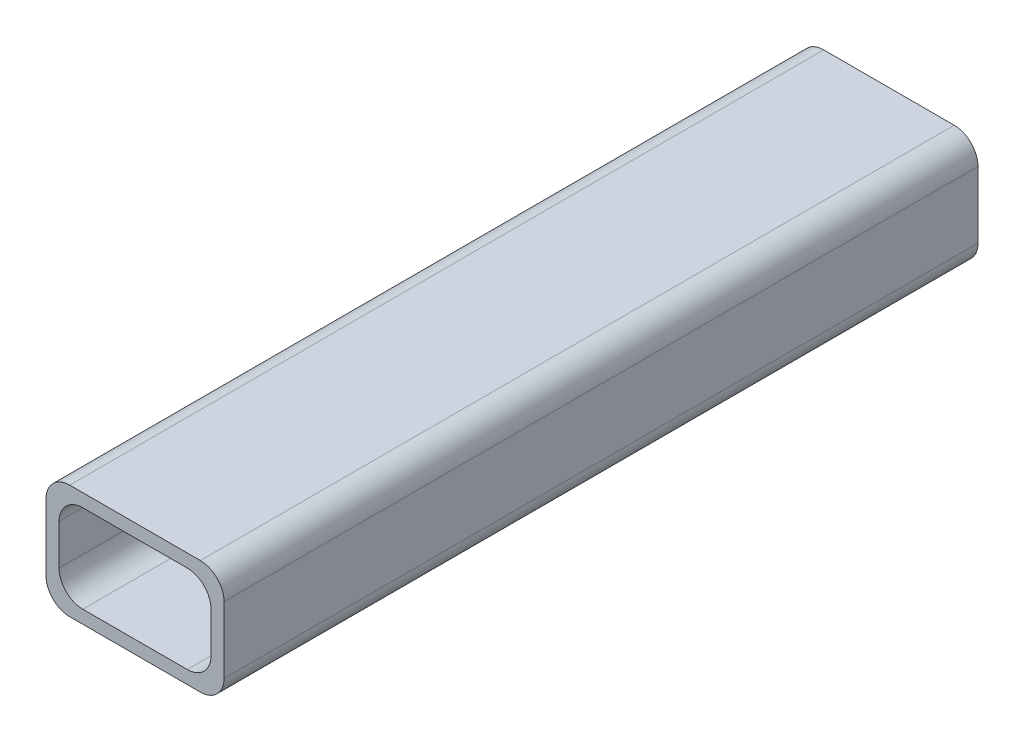
ISO-10303-21;
HEADER;
FILE_DESCRIPTION(('STEP AP214'),'2;1');
FILE_NAME('part.step','',(''),(''),'','','');
FILE_SCHEMA(('AUTOMOTIVE_DESIGN { 1 0 10303 214 1 1 1 1 }'));
ENDSEC;
DATA;
#1=APPLICATION_CONTEXT('core data for automotive mechanical design processes');
#2=APPLICATION_PROTOCOL_DEFINITION('international standard','automotive_design',2000,#1);
#3=PRODUCT_CONTEXT('',#1,'mechanical');
#4=PRODUCT('Part','Part','',(#3));
#5=PRODUCT_RELATED_PRODUCT_CATEGORY('part','',(#4));
#6=PRODUCT_DEFINITION_FORMATION('','',#4);
#7=PRODUCT_DEFINITION_CONTEXT('part definition',#1,'design');
#8=PRODUCT_DEFINITION('design','',#6,#7);
#9=PRODUCT_DEFINITION_SHAPE('','',#8);
#10=(LENGTH_UNIT() NAMED_UNIT(*) SI_UNIT(.MILLI.,.METRE.));
#11=(NAMED_UNIT(*) PLANE_ANGLE_UNIT() SI_UNIT($,.RADIAN.));
#12=(NAMED_UNIT(*) SI_UNIT($,.STERADIAN.) SOLID_ANGLE_UNIT());
#13=UNCERTAINTY_MEASURE_WITH_UNIT(LENGTH_MEASURE(1.E-05),#10,'distance_accuracy_value','');
#14=(GEOMETRIC_REPRESENTATION_CONTEXT(3) GLOBAL_UNCERTAINTY_ASSIGNED_CONTEXT((#13)) GLOBAL_UNIT_ASSIGNED_CONTEXT((#10,
#11,#12)) REPRESENTATION_CONTEXT('',''));
#15=CARTESIAN_POINT('',(0.,0.,0.));
#16=DIRECTION('',(0.,0.,1.));
#17=DIRECTION('',(1.,0.,0.));
#18=AXIS2_PLACEMENT_3D('',#15,#16,#17);
#19=CARTESIAN_POINT('',(15.,-9.6,-63.5));
#20=DIRECTION('',(1.,0.,0.));
#21=DIRECTION('',(0.,0.,-1.));
#22=AXIS2_PLACEMENT_3D('',#19,#20,#21);
#23=PLANE('',#22);
#24=DIRECTION('',(0.,1.,0.));
#25=VECTOR('',#24,1.);
#26=CARTESIAN_POINT('',(15.,-9.6,63.5));
#27=LINE('',#26,#25);
#28=CARTESIAN_POINT('',(15.,-5.6,63.5));
#29=VERTEX_POINT('',#28);
#30=CARTESIAN_POINT('',(15.,5.6,63.5));
#31=VERTEX_POINT('',#30);
#32=EDGE_CURVE('E177',#29,#31,#27,.T.);
#33=ORIENTED_EDGE('',*,*,#32,.F.);
#34=DIRECTION('',(0.,0.,1.));
#35=VECTOR('',#34,1.);
#36=CARTESIAN_POINT('',(15.,-5.6,-63.5));
#37=LINE('',#36,#35);
#38=CARTESIAN_POINT('',(15.,-5.6,-63.5));
#39=VERTEX_POINT('',#38);
#40=EDGE_CURVE('E258',#29,#39,#37,.F.);
#41=ORIENTED_EDGE('',*,*,#40,.T.);
#42=DIRECTION('',(0.,1.,0.));
#43=VECTOR('',#42,1.);
#44=CARTESIAN_POINT('',(15.,-9.6,-63.5));
#45=LINE('',#44,#43);
#46=CARTESIAN_POINT('',(15.,5.6,-63.5));
#47=VERTEX_POINT('',#46);
#48=EDGE_CURVE('E205',#39,#47,#45,.T.);
#49=ORIENTED_EDGE('',*,*,#48,.T.);
#50=DIRECTION('',(0.,0.,1.));
#51=VECTOR('',#50,1.);
#52=CARTESIAN_POINT('',(15.,5.6,-63.5));
#53=LINE('',#52,#51);
#54=EDGE_CURVE('E255',#47,#31,#53,.T.);
#55=ORIENTED_EDGE('',*,*,#54,.T.);
#56=EDGE_LOOP('',(#33,#41,#49,#55));
#57=FACE_BOUND('',#56,.T.);
#58=ADVANCED_FACE('F37',(#57),#23,.T.);
#59=CARTESIAN_POINT('',(-15.,-9.6,-63.5));
#60=DIRECTION('',(0.,-1.,0.));
#61=DIRECTION('',(0.,0.,-1.));
#62=AXIS2_PLACEMENT_3D('',#59,#60,#61);
#63=PLANE('',#62);
#64=DIRECTION('',(1.,0.,0.));
#65=VECTOR('',#64,1.);
#66=CARTESIAN_POINT('',(-15.,-9.6,63.5));
#67=LINE('',#66,#65);
#68=CARTESIAN_POINT('',(-11.,-9.6,63.5));
#69=VERTEX_POINT('',#68);
#70=CARTESIAN_POINT('',(11.,-9.6,63.5));
#71=VERTEX_POINT('',#70);
#72=EDGE_CURVE('E192',#69,#71,#67,.T.);
#73=ORIENTED_EDGE('',*,*,#72,.F.);
#74=DIRECTION('',(0.,0.,1.));
#75=VECTOR('',#74,1.);
#76=CARTESIAN_POINT('',(-11.,-9.6,-63.5));
#77=LINE('',#76,#75);
#78=CARTESIAN_POINT('',(-11.,-9.6,-63.5));
#79=VERTEX_POINT('',#78);
#80=EDGE_CURVE('E246',#69,#79,#77,.F.);
#81=ORIENTED_EDGE('',*,*,#80,.T.);
#82=DIRECTION('',(1.,0.,0.));
#83=VECTOR('',#82,1.);
#84=CARTESIAN_POINT('',(-15.,-9.6,-63.5));
#85=LINE('',#84,#83);
#86=CARTESIAN_POINT('',(11.,-9.6,-63.5));
#87=VERTEX_POINT('',#86);
#88=EDGE_CURVE('E213',#79,#87,#85,.T.);
#89=ORIENTED_EDGE('',*,*,#88,.T.);
#90=DIRECTION('',(0.,0.,1.));
#91=VECTOR('',#90,1.);
#92=CARTESIAN_POINT('',(11.,-9.6,-63.5));
#93=LINE('',#92,#91);
#94=EDGE_CURVE('E243',#87,#71,#93,.T.);
#95=ORIENTED_EDGE('',*,*,#94,.T.);
#96=EDGE_LOOP('',(#73,#81,#89,#95));
#97=FACE_BOUND('',#96,.T.);
#98=ADVANCED_FACE('F298',(#97),#63,.T.);
#99=CARTESIAN_POINT('',(-15.,-9.6,-63.5));
#100=DIRECTION('',(-1.,0.,0.));
#101=DIRECTION('',(0.,0.,1.));
#102=AXIS2_PLACEMENT_3D('',#99,#100,#101);
#103=PLANE('',#102);
#104=DIRECTION('',(0.,-1.,0.));
#105=VECTOR('',#104,1.);
#106=CARTESIAN_POINT('',(-15.,-9.6,-63.5));
#107=LINE('',#106,#105);
#108=CARTESIAN_POINT('',(-15.,5.6,-63.5));
#109=VERTEX_POINT('',#108);
#110=CARTESIAN_POINT('',(-15.,-5.6,-63.5));
#111=VERTEX_POINT('',#110);
#112=EDGE_CURVE('E210',#109,#111,#107,.T.);
#113=ORIENTED_EDGE('',*,*,#112,.T.);
#114=DIRECTION('',(0.,0.,1.));
#115=VECTOR('',#114,1.);
#116=CARTESIAN_POINT('',(-15.,-5.6,-63.5));
#117=LINE('',#116,#115);
#118=CARTESIAN_POINT('',(-15.,-5.6,63.5));
#119=VERTEX_POINT('',#118);
#120=EDGE_CURVE('E232',#111,#119,#117,.T.);
#121=ORIENTED_EDGE('',*,*,#120,.T.);
#122=DIRECTION('',(0.,-1.,0.));
#123=VECTOR('',#122,1.);
#124=CARTESIAN_POINT('',(-15.,-9.6,63.5));
#125=LINE('',#124,#123);
#126=CARTESIAN_POINT('',(-15.,5.6,63.5));
#127=VERTEX_POINT('',#126);
#128=EDGE_CURVE('E189',#127,#119,#125,.T.);
#129=ORIENTED_EDGE('',*,*,#128,.F.);
#130=DIRECTION('',(0.,0.,1.));
#131=VECTOR('',#130,1.);
#132=CARTESIAN_POINT('',(-15.,5.6,-63.5));
#133=LINE('',#132,#131);
#134=EDGE_CURVE('E230',#127,#109,#133,.F.);
#135=ORIENTED_EDGE('',*,*,#134,.T.);
#136=EDGE_LOOP('',(#113,#121,#129,#135));
#137=FACE_BOUND('',#136,.T.);
#138=ADVANCED_FACE('F304',(#137),#103,.T.);
#139=CARTESIAN_POINT('',(-15.,9.6,-63.5));
#140=DIRECTION('',(0.,1.,0.));
#141=DIRECTION('',(0.,0.,1.));
#142=AXIS2_PLACEMENT_3D('',#139,#140,#141);
#143=PLANE('',#142);
#144=DIRECTION('',(-1.,0.,0.));
#145=VECTOR('',#144,1.);
#146=CARTESIAN_POINT('',(-15.,9.6,63.5));
#147=LINE('',#146,#145);
#148=CARTESIAN_POINT('',(11.,9.6,63.5));
#149=VERTEX_POINT('',#148);
#150=CARTESIAN_POINT('',(-11.,9.6,63.5));
#151=VERTEX_POINT('',#150);
#152=EDGE_CURVE('E181',#149,#151,#147,.T.);
#153=ORIENTED_EDGE('',*,*,#152,.F.);
#154=DIRECTION('',(0.,0.,1.));
#155=VECTOR('',#154,1.);
#156=CARTESIAN_POINT('',(11.,9.6,-63.5));
#157=LINE('',#156,#155);
#158=CARTESIAN_POINT('',(11.,9.6,-63.5));
#159=VERTEX_POINT('',#158);
#160=EDGE_CURVE('E59',#149,#159,#157,.F.);
#161=ORIENTED_EDGE('',*,*,#160,.T.);
#162=DIRECTION('',(-1.,0.,0.));
#163=VECTOR('',#162,1.);
#164=CARTESIAN_POINT('',(-15.,9.6,-63.5));
#165=LINE('',#164,#163);
#166=CARTESIAN_POINT('',(-11.,9.6,-63.5));
#167=VERTEX_POINT('',#166);
#168=EDGE_CURVE('E208',#159,#167,#165,.T.);
#169=ORIENTED_EDGE('',*,*,#168,.T.);
#170=DIRECTION('',(0.,0.,1.));
#171=VECTOR('',#170,1.);
#172=CARTESIAN_POINT('',(-11.,9.6,-63.5));
#173=LINE('',#172,#171);
#174=EDGE_CURVE('E260',#167,#151,#173,.T.);
#175=ORIENTED_EDGE('',*,*,#174,.T.);
#176=EDGE_LOOP('',(#153,#161,#169,#175));
#177=FACE_BOUND('',#176,.T.);
#178=ADVANCED_FACE('F310',(#177),#143,.T.);
#179=CARTESIAN_POINT('',(0.,0.,-63.5));
#180=DIRECTION('',(0.,0.,-1.));
#181=DIRECTION('',(-1.,0.,0.));
#182=AXIS2_PLACEMENT_3D('',#179,#180,#181);
#183=PLANE('',#182);
#184=DIRECTION('',(1.,0.,0.));
#185=VECTOR('',#184,1.);
#186=CARTESIAN_POINT('',(-12.8,-7.4,-63.5));
#187=LINE('',#186,#185);
#188=CARTESIAN_POINT('',(-8.8,-7.4,-63.5));
#189=VERTEX_POINT('',#188);
#190=CARTESIAN_POINT('',(8.8,-7.4,-63.5));
#191=VERTEX_POINT('',#190);
#192=EDGE_CURVE('E170',#189,#191,#187,.T.);
#193=ORIENTED_EDGE('',*,*,#192,.T.);
#194=CARTESIAN_POINT('',(8.8,-3.4,-63.5));
#195=DIRECTION('',(0.,0.,-1.));
#196=DIRECTION('',(-1.,0.,0.));
#197=AXIS2_PLACEMENT_3D('',#194,#195,#196);
#198=CIRCLE('',#197,4.);
#199=CARTESIAN_POINT('',(12.8,-3.4,-63.5));
#200=VERTEX_POINT('',#199);
#201=EDGE_CURVE('E266',#191,#200,#198,.F.);
#202=ORIENTED_EDGE('',*,*,#201,.T.);
#203=DIRECTION('',(0.,1.,0.));
#204=VECTOR('',#203,1.);
#205=CARTESIAN_POINT('',(12.8,-7.4,-63.5));
#206=LINE('',#205,#204);
#207=CARTESIAN_POINT('',(12.8,3.4,-63.5));
#208=VERTEX_POINT('',#207);
#209=EDGE_CURVE('E195',#200,#208,#206,.T.);
#210=ORIENTED_EDGE('',*,*,#209,.T.);
#211=CARTESIAN_POINT('',(8.8,3.4,-63.5));
#212=DIRECTION('',(0.,0.,-1.));
#213=DIRECTION('',(-1.,0.,0.));
#214=AXIS2_PLACEMENT_3D('',#211,#212,#213);
#215=CIRCLE('',#214,4.);
#216=CARTESIAN_POINT('',(8.8,7.4,-63.5));
#217=VERTEX_POINT('',#216);
#218=EDGE_CURVE('E270',#208,#217,#215,.F.);
#219=ORIENTED_EDGE('',*,*,#218,.T.);
#220=DIRECTION('',(-1.,0.,0.));
#221=VECTOR('',#220,1.);
#222=CARTESIAN_POINT('',(-12.8,7.4,-63.5));
#223=LINE('',#222,#221);
#224=CARTESIAN_POINT('',(-8.8,7.4,-63.5));
#225=VERTEX_POINT('',#224);
#226=EDGE_CURVE('E198',#217,#225,#223,.T.);
#227=ORIENTED_EDGE('',*,*,#226,.T.);
#228=CARTESIAN_POINT('',(-8.8,3.4,-63.5));
#229=DIRECTION('',(0.,0.,-1.));
#230=DIRECTION('',(-1.,0.,0.));
#231=AXIS2_PLACEMENT_3D('',#228,#229,#230);
#232=CIRCLE('',#231,4.);
#233=CARTESIAN_POINT('',(-12.8,3.4,-63.5));
#234=VERTEX_POINT('',#233);
#235=EDGE_CURVE('E11',#225,#234,#232,.F.);
#236=ORIENTED_EDGE('',*,*,#235,.T.);
#237=DIRECTION('',(0.,-1.,0.));
#238=VECTOR('',#237,1.);
#239=CARTESIAN_POINT('',(-12.8,-7.4,-63.5));
#240=LINE('',#239,#238);
#241=CARTESIAN_POINT('',(-12.8,-3.4,-63.5));
#242=VERTEX_POINT('',#241);
#243=EDGE_CURVE('E201',#234,#242,#240,.T.);
#244=ORIENTED_EDGE('',*,*,#243,.T.);
#245=CARTESIAN_POINT('',(-8.8,-3.4,-63.5));
#246=DIRECTION('',(0.,0.,-1.));
#247=DIRECTION('',(-1.,0.,0.));
#248=AXIS2_PLACEMENT_3D('',#245,#246,#247);
#249=CIRCLE('',#248,4.);
#250=EDGE_CURVE('E161',#242,#189,#249,.F.);
#251=ORIENTED_EDGE('',*,*,#250,.T.);
#252=EDGE_LOOP('',(#193,#202,#210,#219,#227,#236,#244,#251));
#253=FACE_BOUND('',#252,.T.);
#254=ORIENTED_EDGE('',*,*,#88,.F.);
#255=CARTESIAN_POINT('',(-11.,-5.6,-63.5));
#256=DIRECTION('',(0.,0.,-1.));
#257=DIRECTION('',(-1.,0.,0.));
#258=AXIS2_PLACEMENT_3D('',#255,#256,#257);
#259=CIRCLE('',#258,4.);
#260=EDGE_CURVE('E253',#79,#111,#259,.T.);
#261=ORIENTED_EDGE('',*,*,#260,.T.);
#262=ORIENTED_EDGE('',*,*,#112,.F.);
#263=CARTESIAN_POINT('',(-11.,5.6,-63.5));
#264=DIRECTION('',(0.,0.,-1.));
#265=DIRECTION('',(-1.,0.,0.));
#266=AXIS2_PLACEMENT_3D('',#263,#264,#265);
#267=CIRCLE('',#266,4.);
#268=EDGE_CURVE('E52',#109,#167,#267,.T.);
#269=ORIENTED_EDGE('',*,*,#268,.T.);
#270=ORIENTED_EDGE('',*,*,#168,.F.);
#271=CARTESIAN_POINT('',(11.,5.6,-63.5));
#272=DIRECTION('',(0.,0.,-1.));
#273=DIRECTION('',(-1.,0.,0.));
#274=AXIS2_PLACEMENT_3D('',#271,#272,#273);
#275=CIRCLE('',#274,4.);
#276=EDGE_CURVE('E249',#159,#47,#275,.T.);
#277=ORIENTED_EDGE('',*,*,#276,.T.);
#278=ORIENTED_EDGE('',*,*,#48,.F.);
#279=CARTESIAN_POINT('',(11.,-5.6,-63.5));
#280=DIRECTION('',(0.,0.,-1.));
#281=DIRECTION('',(-1.,0.,0.));
#282=AXIS2_PLACEMENT_3D('',#279,#280,#281);
#283=CIRCLE('',#282,4.);
#284=EDGE_CURVE('E251',#39,#87,#283,.T.);
#285=ORIENTED_EDGE('',*,*,#284,.T.);
#286=EDGE_LOOP('',(#254,#261,#262,#269,#270,#277,#278,#285));
#287=FACE_BOUND('',#286,.T.);
#288=ADVANCED_FACE('F285',(#253,#287),#183,.T.);
#289=CARTESIAN_POINT('',(12.8,-7.4,-63.5));
#290=DIRECTION('',(1.,0.,0.));
#291=DIRECTION('',(0.,0.,-1.));
#292=AXIS2_PLACEMENT_3D('',#289,#290,#291);
#293=PLANE('',#292);
#294=ORIENTED_EDGE('',*,*,#209,.F.);
#295=DIRECTION('',(0.,0.,1.));
#296=VECTOR('',#295,1.);
#297=CARTESIAN_POINT('',(12.8,-3.4,63.5));
#298=LINE('',#297,#296);
#299=CARTESIAN_POINT('',(12.8,-3.4,63.5));
#300=VERTEX_POINT('',#299);
#301=EDGE_CURVE('E222',#200,#300,#298,.T.);
#302=ORIENTED_EDGE('',*,*,#301,.T.);
#303=DIRECTION('',(0.,1.,0.));
#304=VECTOR('',#303,1.);
#305=CARTESIAN_POINT('',(12.8,-7.4,63.5));
#306=LINE('',#305,#304);
#307=CARTESIAN_POINT('',(12.8,3.4,63.5));
#308=VERTEX_POINT('',#307);
#309=EDGE_CURVE('E280',#300,#308,#306,.T.);
#310=ORIENTED_EDGE('',*,*,#309,.T.);
#311=DIRECTION('',(0.,0.,1.));
#312=VECTOR('',#311,1.);
#313=CARTESIAN_POINT('',(12.8,3.4,-63.5));
#314=LINE('',#313,#312);
#315=EDGE_CURVE('E220',#308,#208,#314,.F.);
#316=ORIENTED_EDGE('',*,*,#315,.T.);
#317=EDGE_LOOP('',(#294,#302,#310,#316));
#318=FACE_BOUND('',#317,.T.);
#319=ADVANCED_FACE('F295',(#318),#293,.F.);
#320=CARTESIAN_POINT('',(-12.8,-7.4,-63.5));
#321=DIRECTION('',(0.,-1.,0.));
#322=DIRECTION('',(0.,0.,-1.));
#323=AXIS2_PLACEMENT_3D('',#320,#321,#322);
#324=PLANE('',#323);
#325=ORIENTED_EDGE('',*,*,#192,.F.);
#326=DIRECTION('',(0.,0.,1.));
#327=VECTOR('',#326,1.);
#328=CARTESIAN_POINT('',(-8.8,-7.4,63.5));
#329=LINE('',#328,#327);
#330=CARTESIAN_POINT('',(-8.8,-7.4,63.5));
#331=VERTEX_POINT('',#330);
#332=EDGE_CURVE('E155',#189,#331,#329,.T.);
#333=ORIENTED_EDGE('',*,*,#332,.T.);
#334=DIRECTION('',(1.,0.,0.));
#335=VECTOR('',#334,1.);
#336=CARTESIAN_POINT('',(-12.8,-7.4,63.5));
#337=LINE('',#336,#335);
#338=CARTESIAN_POINT('',(8.8,-7.4,63.5));
#339=VERTEX_POINT('',#338);
#340=EDGE_CURVE('E167',#331,#339,#337,.T.);
#341=ORIENTED_EDGE('',*,*,#340,.T.);
#342=DIRECTION('',(0.,0.,1.));
#343=VECTOR('',#342,1.);
#344=CARTESIAN_POINT('',(8.8,-7.4,-63.5));
#345=LINE('',#344,#343);
#346=EDGE_CURVE('E172',#339,#191,#345,.F.);
#347=ORIENTED_EDGE('',*,*,#346,.T.);
#348=EDGE_LOOP('',(#325,#333,#341,#347));
#349=FACE_BOUND('',#348,.T.);
#350=ADVANCED_FACE('F166',(#349),#324,.F.);
#351=CARTESIAN_POINT('',(-12.8,-7.4,-63.5));
#352=DIRECTION('',(-1.,0.,0.));
#353=DIRECTION('',(0.,0.,1.));
#354=AXIS2_PLACEMENT_3D('',#351,#352,#353);
#355=PLANE('',#354);
#356=DIRECTION('',(0.,-1.,0.));
#357=VECTOR('',#356,1.);
#358=CARTESIAN_POINT('',(-12.8,-7.4,63.5));
#359=LINE('',#358,#357);
#360=CARTESIAN_POINT('',(-12.8,3.4,63.5));
#361=VERTEX_POINT('',#360);
#362=CARTESIAN_POINT('',(-12.8,-3.4,63.5));
#363=VERTEX_POINT('',#362);
#364=EDGE_CURVE('E178',#361,#363,#359,.T.);
#365=ORIENTED_EDGE('',*,*,#364,.T.);
#366=DIRECTION('',(0.,0.,1.));
#367=VECTOR('',#366,1.);
#368=CARTESIAN_POINT('',(-12.8,-3.4,-63.5));
#369=LINE('',#368,#367);
#370=EDGE_CURVE('E156',#363,#242,#369,.F.);
#371=ORIENTED_EDGE('',*,*,#370,.T.);
#372=ORIENTED_EDGE('',*,*,#243,.F.);
#373=DIRECTION('',(0.,0.,1.));
#374=VECTOR('',#373,1.);
#375=CARTESIAN_POINT('',(-12.8,3.4,63.5));
#376=LINE('',#375,#374);
#377=EDGE_CURVE('E171',#234,#361,#376,.T.);
#378=ORIENTED_EDGE('',*,*,#377,.T.);
#379=EDGE_LOOP('',(#365,#371,#372,#378));
#380=FACE_BOUND('',#379,.T.);
#381=ADVANCED_FACE('F287',(#380),#355,.F.);
#382=CARTESIAN_POINT('',(-12.8,7.4,-63.5));
#383=DIRECTION('',(0.,1.,0.));
#384=DIRECTION('',(0.,0.,1.));
#385=AXIS2_PLACEMENT_3D('',#382,#383,#384);
#386=PLANE('',#385);
#387=ORIENTED_EDGE('',*,*,#226,.F.);
#388=DIRECTION('',(0.,0.,1.));
#389=VECTOR('',#388,1.);
#390=CARTESIAN_POINT('',(8.8,7.4,63.5));
#391=LINE('',#390,#389);
#392=CARTESIAN_POINT('',(8.8,7.4,63.5));
#393=VERTEX_POINT('',#392);
#394=EDGE_CURVE('E227',#217,#393,#391,.T.);
#395=ORIENTED_EDGE('',*,*,#394,.T.);
#396=DIRECTION('',(-1.,0.,0.));
#397=VECTOR('',#396,1.);
#398=CARTESIAN_POINT('',(-12.8,7.4,63.5));
#399=LINE('',#398,#397);
#400=CARTESIAN_POINT('',(-8.8,7.4,63.5));
#401=VERTEX_POINT('',#400);
#402=EDGE_CURVE('E183',#393,#401,#399,.T.);
#403=ORIENTED_EDGE('',*,*,#402,.T.);
#404=DIRECTION('',(0.,0.,1.));
#405=VECTOR('',#404,1.);
#406=CARTESIAN_POINT('',(-8.8,7.4,-63.5));
#407=LINE('',#406,#405);
#408=EDGE_CURVE('E225',#401,#225,#407,.F.);
#409=ORIENTED_EDGE('',*,*,#408,.T.);
#410=EDGE_LOOP('',(#387,#395,#403,#409));
#411=FACE_BOUND('',#410,.T.);
#412=ADVANCED_FACE('F278',(#411),#386,.F.);
#413=CARTESIAN_POINT('',(0.,0.,63.5));
#414=DIRECTION('',(0.,0.,-1.));
#415=DIRECTION('',(-1.,0.,0.));
#416=AXIS2_PLACEMENT_3D('',#413,#414,#415);
#417=PLANE('',#416);
#418=ORIENTED_EDGE('',*,*,#128,.T.);
#419=CARTESIAN_POINT('',(-11.,-5.6,63.5));
#420=DIRECTION('',(0.,0.,-1.));
#421=DIRECTION('',(-1.,0.,0.));
#422=AXIS2_PLACEMENT_3D('',#419,#420,#421);
#423=CIRCLE('',#422,4.);
#424=EDGE_CURVE('E241',#119,#69,#423,.F.);
#425=ORIENTED_EDGE('',*,*,#424,.T.);
#426=ORIENTED_EDGE('',*,*,#72,.T.);
#427=CARTESIAN_POINT('',(11.,-5.6,63.5));
#428=DIRECTION('',(0.,0.,-1.));
#429=DIRECTION('',(-1.,0.,0.));
#430=AXIS2_PLACEMENT_3D('',#427,#428,#429);
#431=CIRCLE('',#430,4.);
#432=EDGE_CURVE('E239',#71,#29,#431,.F.);
#433=ORIENTED_EDGE('',*,*,#432,.T.);
#434=ORIENTED_EDGE('',*,*,#32,.T.);
#435=CARTESIAN_POINT('',(11.,5.6,63.5));
#436=DIRECTION('',(0.,0.,-1.));
#437=DIRECTION('',(-1.,0.,0.));
#438=AXIS2_PLACEMENT_3D('',#435,#436,#437);
#439=CIRCLE('',#438,4.);
#440=EDGE_CURVE('E237',#31,#149,#439,.F.);
#441=ORIENTED_EDGE('',*,*,#440,.T.);
#442=ORIENTED_EDGE('',*,*,#152,.T.);
#443=CARTESIAN_POINT('',(-11.,5.6,63.5));
#444=DIRECTION('',(0.,0.,-1.));
#445=DIRECTION('',(-1.,0.,0.));
#446=AXIS2_PLACEMENT_3D('',#443,#444,#445);
#447=CIRCLE('',#446,4.);
#448=EDGE_CURVE('E235',#151,#127,#447,.F.);
#449=ORIENTED_EDGE('',*,*,#448,.T.);
#450=EDGE_LOOP('',(#418,#425,#426,#433,#434,#441,#442,#449));
#451=FACE_BOUND('',#450,.T.);
#452=ORIENTED_EDGE('',*,*,#309,.F.);
#453=CARTESIAN_POINT('',(8.8,-3.4,63.5));
#454=DIRECTION('',(0.,0.,-1.));
#455=DIRECTION('',(-1.,0.,0.));
#456=AXIS2_PLACEMENT_3D('',#453,#454,#455);
#457=CIRCLE('',#456,4.);
#458=EDGE_CURVE('E176',#300,#339,#457,.T.);
#459=ORIENTED_EDGE('',*,*,#458,.T.);
#460=ORIENTED_EDGE('',*,*,#340,.F.);
#461=CARTESIAN_POINT('',(-8.8,-3.4,63.5));
#462=DIRECTION('',(0.,0.,-1.));
#463=DIRECTION('',(-1.,0.,0.));
#464=AXIS2_PLACEMENT_3D('',#461,#462,#463);
#465=CIRCLE('',#464,4.);
#466=EDGE_CURVE('E151',#331,#363,#465,.T.);
#467=ORIENTED_EDGE('',*,*,#466,.T.);
#468=ORIENTED_EDGE('',*,*,#364,.F.);
#469=CARTESIAN_POINT('',(-8.8,3.4,63.5));
#470=DIRECTION('',(0.,0.,-1.));
#471=DIRECTION('',(-1.,0.,0.));
#472=AXIS2_PLACEMENT_3D('',#469,#470,#471);
#473=CIRCLE('',#472,4.);
#474=EDGE_CURVE('E45',#361,#401,#473,.T.);
#475=ORIENTED_EDGE('',*,*,#474,.T.);
#476=ORIENTED_EDGE('',*,*,#402,.F.);
#477=CARTESIAN_POINT('',(8.8,3.4,63.5));
#478=DIRECTION('',(0.,0.,-1.));
#479=DIRECTION('',(-1.,0.,0.));
#480=AXIS2_PLACEMENT_3D('',#477,#478,#479);
#481=CIRCLE('',#480,4.);
#482=EDGE_CURVE('E268',#393,#308,#481,.T.);
#483=ORIENTED_EDGE('',*,*,#482,.T.);
#484=EDGE_LOOP('',(#452,#459,#460,#467,#468,#475,#476,#483));
#485=FACE_BOUND('',#484,.T.);
#486=ADVANCED_FACE('F175',(#451,#485),#417,.F.);
#487=CARTESIAN_POINT('',(-8.8,-3.4,-63.5));
#488=DIRECTION('',(0.,0.,-1.));
#489=DIRECTION('',(-1.,0.,0.));
#490=AXIS2_PLACEMENT_3D('',#487,#488,#489);
#491=CYLINDRICAL_SURFACE('',#490,4.);
#492=ORIENTED_EDGE('',*,*,#250,.F.);
#493=ORIENTED_EDGE('',*,*,#370,.F.);
#494=ORIENTED_EDGE('',*,*,#466,.F.);
#495=ORIENTED_EDGE('',*,*,#332,.F.);
#496=EDGE_LOOP('',(#492,#493,#494,#495));
#497=FACE_BOUND('',#496,.T.);
#498=ADVANCED_FACE('F154',(#497),#491,.F.);
#499=CARTESIAN_POINT('',(8.8,-3.4,-63.5));
#500=DIRECTION('',(0.,0.,-1.));
#501=DIRECTION('',(-1.,0.,0.));
#502=AXIS2_PLACEMENT_3D('',#499,#500,#501);
#503=CYLINDRICAL_SURFACE('',#502,4.);
#504=ORIENTED_EDGE('',*,*,#201,.F.);
#505=ORIENTED_EDGE('',*,*,#346,.F.);
#506=ORIENTED_EDGE('',*,*,#458,.F.);
#507=ORIENTED_EDGE('',*,*,#301,.F.);
#508=EDGE_LOOP('',(#504,#505,#506,#507));
#509=FACE_BOUND('',#508,.T.);
#510=ADVANCED_FACE('F314',(#509),#503,.F.);
#511=CARTESIAN_POINT('',(8.8,3.4,-63.5));
#512=DIRECTION('',(0.,0.,-1.));
#513=DIRECTION('',(-1.,0.,0.));
#514=AXIS2_PLACEMENT_3D('',#511,#512,#513);
#515=CYLINDRICAL_SURFACE('',#514,4.);
#516=ORIENTED_EDGE('',*,*,#218,.F.);
#517=ORIENTED_EDGE('',*,*,#315,.F.);
#518=ORIENTED_EDGE('',*,*,#482,.F.);
#519=ORIENTED_EDGE('',*,*,#394,.F.);
#520=EDGE_LOOP('',(#516,#517,#518,#519));
#521=FACE_BOUND('',#520,.T.);
#522=ADVANCED_FACE('F317',(#521),#515,.F.);
#523=CARTESIAN_POINT('',(-8.8,3.4,-63.5));
#524=DIRECTION('',(0.,0.,-1.));
#525=DIRECTION('',(-1.,0.,0.));
#526=AXIS2_PLACEMENT_3D('',#523,#524,#525);
#527=CYLINDRICAL_SURFACE('',#526,4.);
#528=ORIENTED_EDGE('',*,*,#235,.F.);
#529=ORIENTED_EDGE('',*,*,#408,.F.);
#530=ORIENTED_EDGE('',*,*,#474,.F.);
#531=ORIENTED_EDGE('',*,*,#377,.F.);
#532=EDGE_LOOP('',(#528,#529,#530,#531));
#533=FACE_BOUND('',#532,.T.);
#534=ADVANCED_FACE('F282',(#533),#527,.F.);
#535=CARTESIAN_POINT('',(-11.,-5.6,-63.5));
#536=DIRECTION('',(0.,0.,1.));
#537=DIRECTION('',(1.,0.,0.));
#538=AXIS2_PLACEMENT_3D('',#535,#536,#537);
#539=CYLINDRICAL_SURFACE('',#538,4.);
#540=ORIENTED_EDGE('',*,*,#260,.F.);
#541=ORIENTED_EDGE('',*,*,#80,.F.);
#542=ORIENTED_EDGE('',*,*,#424,.F.);
#543=ORIENTED_EDGE('',*,*,#120,.F.);
#544=EDGE_LOOP('',(#540,#541,#542,#543));
#545=FACE_BOUND('',#544,.T.);
#546=ADVANCED_FACE('F324',(#545),#539,.T.);
#547=CARTESIAN_POINT('',(11.,-5.6,-63.5));
#548=DIRECTION('',(0.,0.,1.));
#549=DIRECTION('',(1.,0.,0.));
#550=AXIS2_PLACEMENT_3D('',#547,#548,#549);
#551=CYLINDRICAL_SURFACE('',#550,4.);
#552=ORIENTED_EDGE('',*,*,#284,.F.);
#553=ORIENTED_EDGE('',*,*,#40,.F.);
#554=ORIENTED_EDGE('',*,*,#432,.F.);
#555=ORIENTED_EDGE('',*,*,#94,.F.);
#556=EDGE_LOOP('',(#552,#553,#554,#555));
#557=FACE_BOUND('',#556,.T.);
#558=ADVANCED_FACE('F327',(#557),#551,.T.);
#559=CARTESIAN_POINT('',(11.,5.6,-63.5));
#560=DIRECTION('',(0.,0.,1.));
#561=DIRECTION('',(1.,0.,0.));
#562=AXIS2_PLACEMENT_3D('',#559,#560,#561);
#563=CYLINDRICAL_SURFACE('',#562,4.);
#564=ORIENTED_EDGE('',*,*,#276,.F.);
#565=ORIENTED_EDGE('',*,*,#160,.F.);
#566=ORIENTED_EDGE('',*,*,#440,.F.);
#567=ORIENTED_EDGE('',*,*,#54,.F.);
#568=EDGE_LOOP('',(#564,#565,#566,#567));
#569=FACE_BOUND('',#568,.T.);
#570=ADVANCED_FACE('F330',(#569),#563,.T.);
#571=CARTESIAN_POINT('',(-11.,5.6,-63.5));
#572=DIRECTION('',(0.,0.,1.));
#573=DIRECTION('',(1.,0.,0.));
#574=AXIS2_PLACEMENT_3D('',#571,#572,#573);
#575=CYLINDRICAL_SURFACE('',#574,4.);
#576=ORIENTED_EDGE('',*,*,#268,.F.);
#577=ORIENTED_EDGE('',*,*,#134,.F.);
#578=ORIENTED_EDGE('',*,*,#448,.F.);
#579=ORIENTED_EDGE('',*,*,#174,.F.);
#580=EDGE_LOOP('',(#576,#577,#578,#579));
#581=FACE_BOUND('',#580,.T.);
#582=ADVANCED_FACE('F39',(#581),#575,.T.);
#583=CLOSED_SHELL('',(#58,#98,#138,#178,#288,#319,#350,#381,#412,#486,#498,#510,#522,#534,#546,
#558,#570,#582));
#584=MANIFOLD_SOLID_BREP('B2',#583);
#585=ADVANCED_BREP_SHAPE_REPRESENTATION('',(#18,#584),#14);
#586=SHAPE_DEFINITION_REPRESENTATION(#9,#585);
ENDSEC;
END-ISO-10303-21;
